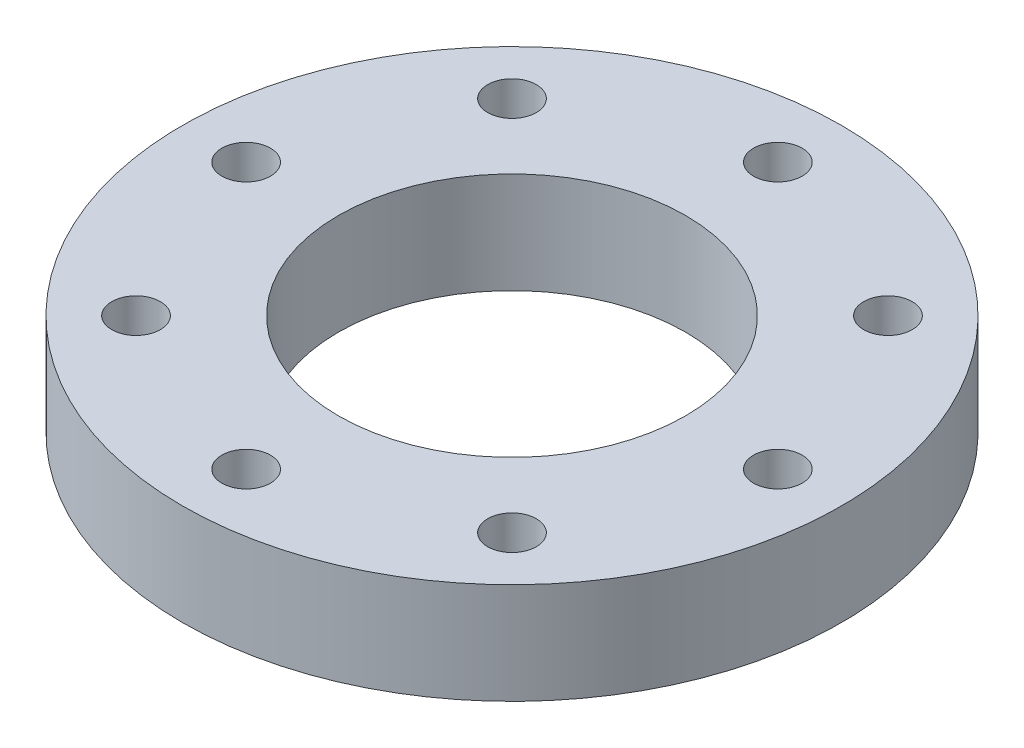
ISO-10303-21;
HEADER;
FILE_DESCRIPTION(('STEP AP214'),'2;1');
FILE_NAME('part.step','',(''),(''),'','','');
FILE_SCHEMA(('AUTOMOTIVE_DESIGN { 1 0 10303 214 1 1 1 1 }'));
ENDSEC;
DATA;
#1=APPLICATION_CONTEXT('core data for automotive mechanical design processes');
#2=APPLICATION_PROTOCOL_DEFINITION('international standard','automotive_design',2000,#1);
#3=PRODUCT_CONTEXT('',#1,'mechanical');
#4=PRODUCT('Part','Part','',(#3));
#5=PRODUCT_RELATED_PRODUCT_CATEGORY('part','',(#4));
#6=PRODUCT_DEFINITION_FORMATION('','',#4);
#7=PRODUCT_DEFINITION_CONTEXT('part definition',#1,'design');
#8=PRODUCT_DEFINITION('design','',#6,#7);
#9=PRODUCT_DEFINITION_SHAPE('','',#8);
#10=(LENGTH_UNIT() NAMED_UNIT(*) SI_UNIT(.MILLI.,.METRE.));
#11=(NAMED_UNIT(*) PLANE_ANGLE_UNIT() SI_UNIT($,.RADIAN.));
#12=(NAMED_UNIT(*) SI_UNIT($,.STERADIAN.) SOLID_ANGLE_UNIT());
#13=UNCERTAINTY_MEASURE_WITH_UNIT(LENGTH_MEASURE(1.E-05),#10,'distance_accuracy_value','');
#14=(GEOMETRIC_REPRESENTATION_CONTEXT(3) GLOBAL_UNCERTAINTY_ASSIGNED_CONTEXT((#13)) GLOBAL_UNIT_ASSIGNED_CONTEXT((#10,
#11,#12)) REPRESENTATION_CONTEXT('',''));
#15=CARTESIAN_POINT('',(0.,0.,0.));
#16=DIRECTION('',(0.,0.,1.));
#17=DIRECTION('',(1.,0.,0.));
#18=AXIS2_PLACEMENT_3D('',#15,#16,#17);
#19=CARTESIAN_POINT('',(0.,17.526,0.));
#20=DIRECTION('',(0.,1.,0.));
#21=DIRECTION('',(0.,0.,1.));
#22=AXIS2_PLACEMENT_3D('',#19,#20,#21);
#23=PLANE('',#22);
#24=CARTESIAN_POINT('',(46.101,17.526,-4.82882343606022E-13));
#25=DIRECTION('',(0.,1.,0.));
#26=DIRECTION('',(-1.,0.,0.));
#27=AXIS2_PLACEMENT_3D('',#24,#25,#26);
#28=CIRCLE('',#27,4.2164);
#29=CARTESIAN_POINT('',(41.8846,17.526,-4.38717897854727E-13));
#30=VERTEX_POINT('',#29);
#31=EDGE_CURVE('E90',#30,#30,#28,.T.);
#32=ORIENTED_EDGE('',*,*,#31,.F.);
#33=EDGE_LOOP('',(#32));
#34=FACE_BOUND('',#33,.T.);
#35=CARTESIAN_POINT('',(3.21921562404015E-13,17.526,46.101));
#36=DIRECTION('',(0.,1.,0.));
#37=DIRECTION('',(0.,0.,-1.));
#38=AXIS2_PLACEMENT_3D('',#35,#36,#37);
#39=CIRCLE('',#38,4.2164);
#40=CARTESIAN_POINT('',(2.92478598569818E-13,17.526,41.8846));
#41=VERTEX_POINT('',#40);
#42=EDGE_CURVE('E78',#41,#41,#39,.T.);
#43=ORIENTED_EDGE('',*,*,#42,.F.);
#44=EDGE_LOOP('',(#43));
#45=FACE_BOUND('',#44,.T.);
#46=CARTESIAN_POINT('',(-46.101,17.526,1.60960781202007E-13));
#47=DIRECTION('',(0.,1.,0.));
#48=DIRECTION('',(1.,0.,0.));
#49=AXIS2_PLACEMENT_3D('',#46,#47,#48);
#50=CIRCLE('',#49,4.2164);
#51=CARTESIAN_POINT('',(-41.8846,17.526,1.46239299284909E-13));
#52=VERTEX_POINT('',#51);
#53=EDGE_CURVE('E66',#52,#52,#50,.T.);
#54=ORIENTED_EDGE('',*,*,#53,.F.);
#55=EDGE_LOOP('',(#54));
#56=FACE_BOUND('',#55,.T.);
#57=CARTESIAN_POINT('',(0.,17.526,-46.101));
#58=DIRECTION('',(0.,1.,0.));
#59=DIRECTION('',(0.,0.,1.));
#60=AXIS2_PLACEMENT_3D('',#57,#58,#59);
#61=CIRCLE('',#60,4.2164);
#62=CARTESIAN_POINT('',(0.,17.526,-41.8846));
#63=VERTEX_POINT('',#62);
#64=EDGE_CURVE('E54',#63,#63,#61,.T.);
#65=ORIENTED_EDGE('',*,*,#64,.F.);
#66=EDGE_LOOP('',(#65));
#67=FACE_BOUND('',#66,.T.);
#68=CARTESIAN_POINT('',(0.,17.526,0.));
#69=DIRECTION('',(0.,1.,0.));
#70=DIRECTION('',(0.,0.,1.));
#71=AXIS2_PLACEMENT_3D('',#68,#69,#70);
#72=CIRCLE('',#71,57.15);
#73=CARTESIAN_POINT('',(0.,17.526,57.15));
#74=VERTEX_POINT('',#73);
#75=EDGE_CURVE('E11',#74,#74,#72,.T.);
#76=ORIENTED_EDGE('',*,*,#75,.T.);
#77=EDGE_LOOP('',(#76));
#78=FACE_BOUND('',#77,.T.);
#79=CARTESIAN_POINT('',(0.,17.526,0.));
#80=DIRECTION('',(0.,1.,0.));
#81=DIRECTION('',(1.,0.,0.));
#82=AXIS2_PLACEMENT_3D('',#79,#80,#81);
#83=CIRCLE('',#82,30.099);
#84=CARTESIAN_POINT('',(30.099,17.526,0.));
#85=VERTEX_POINT('',#84);
#86=EDGE_CURVE('E49',#85,#85,#83,.T.);
#87=ORIENTED_EDGE('',*,*,#86,.F.);
#88=EDGE_LOOP('',(#87));
#89=FACE_BOUND('',#88,.T.);
#90=CARTESIAN_POINT('',(-32.5983297194811,17.526,-32.598329719481));
#91=DIRECTION('',(0.,1.,0.));
#92=DIRECTION('',(0.707106781186549,0.,0.707106781186546));
#93=AXIS2_PLACEMENT_3D('',#90,#91,#92);
#94=CIRCLE('',#93,4.2164);
#95=CARTESIAN_POINT('',(-29.6168846872861,17.526,-29.616884687286));
#96=VERTEX_POINT('',#95);
#97=EDGE_CURVE('E60',#96,#96,#94,.T.);
#98=ORIENTED_EDGE('',*,*,#97,.F.);
#99=EDGE_LOOP('',(#98));
#100=FACE_BOUND('',#99,.T.);
#101=CARTESIAN_POINT('',(-32.5983297194809,17.526,32.5983297194812));
#102=DIRECTION('',(0.,1.,0.));
#103=DIRECTION('',(0.707106781186544,0.,-0.707106781186551));
#104=AXIS2_PLACEMENT_3D('',#101,#102,#103);
#105=CIRCLE('',#104,4.2164);
#106=CARTESIAN_POINT('',(-29.6168846872859,17.526,29.6168846872862));
#107=VERTEX_POINT('',#106);
#108=EDGE_CURVE('E72',#107,#107,#105,.T.);
#109=ORIENTED_EDGE('',*,*,#108,.F.);
#110=EDGE_LOOP('',(#109));
#111=FACE_BOUND('',#110,.T.);
#112=CARTESIAN_POINT('',(32.5983297194813,17.526,32.5983297194807));
#113=DIRECTION('',(0.,1.,0.));
#114=DIRECTION('',(-0.707106781186554,0.,-0.707106781186541));
#115=AXIS2_PLACEMENT_3D('',#112,#113,#114);
#116=CIRCLE('',#115,4.2164);
#117=CARTESIAN_POINT('',(29.6168846872863,17.526,29.6168846872858));
#118=VERTEX_POINT('',#117);
#119=EDGE_CURVE('E84',#118,#118,#116,.T.);
#120=ORIENTED_EDGE('',*,*,#119,.F.);
#121=EDGE_LOOP('',(#120));
#122=FACE_BOUND('',#121,.T.);
#123=CARTESIAN_POINT('',(32.5983297194806,17.526,-32.5983297194814));
#124=DIRECTION('',(0.,1.,0.));
#125=DIRECTION('',(-0.707106781186539,0.,0.707106781186556));
#126=AXIS2_PLACEMENT_3D('',#123,#124,#125);
#127=CIRCLE('',#126,4.2164);
#128=CARTESIAN_POINT('',(29.6168846872857,17.526,-29.6168846872864));
#129=VERTEX_POINT('',#128);
#130=EDGE_CURVE('E96',#129,#129,#127,.T.);
#131=ORIENTED_EDGE('',*,*,#130,.F.);
#132=EDGE_LOOP('',(#131));
#133=FACE_BOUND('',#132,.T.);
#134=ADVANCED_FACE('F38',(#34,#45,#56,#67,#78,#89,#100,#111,#122,#133),#23,.T.);
#135=CARTESIAN_POINT('',(0.,0.,0.));
#136=DIRECTION('',(0.,1.,0.));
#137=DIRECTION('',(0.,0.,1.));
#138=AXIS2_PLACEMENT_3D('',#135,#136,#137);
#139=PLANE('',#138);
#140=CARTESIAN_POINT('',(46.101,0.,-4.82882343606022E-13));
#141=DIRECTION('',(0.,1.,0.));
#142=DIRECTION('',(-1.,0.,0.));
#143=AXIS2_PLACEMENT_3D('',#140,#141,#142);
#144=CIRCLE('',#143,4.2164);
#145=CARTESIAN_POINT('',(41.8846,0.,-4.38717897854727E-13));
#146=VERTEX_POINT('',#145);
#147=EDGE_CURVE('E93',#146,#146,#144,.T.);
#148=ORIENTED_EDGE('',*,*,#147,.T.);
#149=EDGE_LOOP('',(#148));
#150=FACE_BOUND('',#149,.T.);
#151=CARTESIAN_POINT('',(3.21921562404015E-13,0.,46.101));
#152=DIRECTION('',(0.,1.,0.));
#153=DIRECTION('',(0.,0.,-1.));
#154=AXIS2_PLACEMENT_3D('',#151,#152,#153);
#155=CIRCLE('',#154,4.2164);
#156=CARTESIAN_POINT('',(2.92478598569818E-13,0.,41.8846));
#157=VERTEX_POINT('',#156);
#158=EDGE_CURVE('E81',#157,#157,#155,.T.);
#159=ORIENTED_EDGE('',*,*,#158,.T.);
#160=EDGE_LOOP('',(#159));
#161=FACE_BOUND('',#160,.T.);
#162=CARTESIAN_POINT('',(-46.101,0.,1.60960781202007E-13));
#163=DIRECTION('',(0.,1.,0.));
#164=DIRECTION('',(1.,0.,0.));
#165=AXIS2_PLACEMENT_3D('',#162,#163,#164);
#166=CIRCLE('',#165,4.2164);
#167=CARTESIAN_POINT('',(-41.8846,0.,1.46239299284909E-13));
#168=VERTEX_POINT('',#167);
#169=EDGE_CURVE('E69',#168,#168,#166,.T.);
#170=ORIENTED_EDGE('',*,*,#169,.T.);
#171=EDGE_LOOP('',(#170));
#172=FACE_BOUND('',#171,.T.);
#173=CARTESIAN_POINT('',(0.,0.,-46.101));
#174=DIRECTION('',(0.,1.,0.));
#175=DIRECTION('',(0.,0.,1.));
#176=AXIS2_PLACEMENT_3D('',#173,#174,#175);
#177=CIRCLE('',#176,4.2164);
#178=CARTESIAN_POINT('',(0.,0.,-41.8846));
#179=VERTEX_POINT('',#178);
#180=EDGE_CURVE('E57',#179,#179,#177,.T.);
#181=ORIENTED_EDGE('',*,*,#180,.T.);
#182=EDGE_LOOP('',(#181));
#183=FACE_BOUND('',#182,.T.);
#184=CARTESIAN_POINT('',(0.,0.,0.));
#185=DIRECTION('',(0.,1.,0.));
#186=DIRECTION('',(0.,0.,1.));
#187=AXIS2_PLACEMENT_3D('',#184,#185,#186);
#188=CIRCLE('',#187,57.15);
#189=CARTESIAN_POINT('',(0.,0.,57.15));
#190=VERTEX_POINT('',#189);
#191=EDGE_CURVE('E42',#190,#190,#188,.T.);
#192=ORIENTED_EDGE('',*,*,#191,.F.);
#193=EDGE_LOOP('',(#192));
#194=FACE_BOUND('',#193,.T.);
#195=CARTESIAN_POINT('',(0.,0.,0.));
#196=DIRECTION('',(0.,1.,0.));
#197=DIRECTION('',(1.,0.,0.));
#198=AXIS2_PLACEMENT_3D('',#195,#196,#197);
#199=CIRCLE('',#198,30.099);
#200=CARTESIAN_POINT('',(30.099,0.,0.));
#201=VERTEX_POINT('',#200);
#202=EDGE_CURVE('E51',#201,#201,#199,.T.);
#203=ORIENTED_EDGE('',*,*,#202,.T.);
#204=EDGE_LOOP('',(#203));
#205=FACE_BOUND('',#204,.T.);
#206=CARTESIAN_POINT('',(-32.5983297194811,0.,-32.598329719481));
#207=DIRECTION('',(0.,1.,0.));
#208=DIRECTION('',(0.707106781186549,0.,0.707106781186546));
#209=AXIS2_PLACEMENT_3D('',#206,#207,#208);
#210=CIRCLE('',#209,4.2164);
#211=CARTESIAN_POINT('',(-29.6168846872861,0.,-29.616884687286));
#212=VERTEX_POINT('',#211);
#213=EDGE_CURVE('E63',#212,#212,#210,.T.);
#214=ORIENTED_EDGE('',*,*,#213,.T.);
#215=EDGE_LOOP('',(#214));
#216=FACE_BOUND('',#215,.T.);
#217=CARTESIAN_POINT('',(-32.5983297194809,0.,32.5983297194812));
#218=DIRECTION('',(0.,1.,0.));
#219=DIRECTION('',(0.707106781186544,0.,-0.707106781186551));
#220=AXIS2_PLACEMENT_3D('',#217,#218,#219);
#221=CIRCLE('',#220,4.2164);
#222=CARTESIAN_POINT('',(-29.6168846872859,0.,29.6168846872862));
#223=VERTEX_POINT('',#222);
#224=EDGE_CURVE('E75',#223,#223,#221,.T.);
#225=ORIENTED_EDGE('',*,*,#224,.T.);
#226=EDGE_LOOP('',(#225));
#227=FACE_BOUND('',#226,.T.);
#228=CARTESIAN_POINT('',(32.5983297194813,0.,32.5983297194807));
#229=DIRECTION('',(0.,1.,0.));
#230=DIRECTION('',(-0.707106781186554,0.,-0.707106781186541));
#231=AXIS2_PLACEMENT_3D('',#228,#229,#230);
#232=CIRCLE('',#231,4.2164);
#233=CARTESIAN_POINT('',(29.6168846872863,0.,29.6168846872858));
#234=VERTEX_POINT('',#233);
#235=EDGE_CURVE('E87',#234,#234,#232,.T.);
#236=ORIENTED_EDGE('',*,*,#235,.T.);
#237=EDGE_LOOP('',(#236));
#238=FACE_BOUND('',#237,.T.);
#239=CARTESIAN_POINT('',(32.5983297194806,0.,-32.5983297194814));
#240=DIRECTION('',(0.,1.,0.));
#241=DIRECTION('',(-0.707106781186539,0.,0.707106781186556));
#242=AXIS2_PLACEMENT_3D('',#239,#240,#241);
#243=CIRCLE('',#242,4.2164);
#244=CARTESIAN_POINT('',(29.6168846872857,0.,-29.6168846872864));
#245=VERTEX_POINT('',#244);
#246=EDGE_CURVE('E99',#245,#245,#243,.T.);
#247=ORIENTED_EDGE('',*,*,#246,.T.);
#248=EDGE_LOOP('',(#247));
#249=FACE_BOUND('',#248,.T.);
#250=ADVANCED_FACE('F109',(#150,#161,#172,#183,#194,#205,#216,#227,#238,#249),#139,.F.);
#251=CARTESIAN_POINT('',(0.,17.526,0.));
#252=DIRECTION('',(0.,-1.,0.));
#253=DIRECTION('',(0.,0.,-1.));
#254=AXIS2_PLACEMENT_3D('',#251,#252,#253);
#255=CYLINDRICAL_SURFACE('',#254,57.15);
#256=ORIENTED_EDGE('',*,*,#75,.F.);
#257=EDGE_LOOP('',(#256));
#258=FACE_BOUND('',#257,.T.);
#259=ORIENTED_EDGE('',*,*,#191,.T.);
#260=EDGE_LOOP('',(#259));
#261=FACE_BOUND('',#260,.T.);
#262=ADVANCED_FACE('F40',(#258,#261),#255,.T.);
#263=CARTESIAN_POINT('',(0.,17.526,0.));
#264=DIRECTION('',(0.,-1.,0.));
#265=DIRECTION('',(0.,0.,-1.));
#266=AXIS2_PLACEMENT_3D('',#263,#264,#265);
#267=CYLINDRICAL_SURFACE('',#266,30.099);
#268=ORIENTED_EDGE('',*,*,#86,.T.);
#269=EDGE_LOOP('',(#268));
#270=FACE_BOUND('',#269,.T.);
#271=ORIENTED_EDGE('',*,*,#202,.F.);
#272=EDGE_LOOP('',(#271));
#273=FACE_BOUND('',#272,.T.);
#274=ADVANCED_FACE('F119',(#270,#273),#267,.F.);
#275=CARTESIAN_POINT('',(0.,17.526,-46.101));
#276=DIRECTION('',(0.,-1.,0.));
#277=DIRECTION('',(0.,0.,-1.));
#278=AXIS2_PLACEMENT_3D('',#275,#276,#277);
#279=CYLINDRICAL_SURFACE('',#278,4.2164);
#280=ORIENTED_EDGE('',*,*,#64,.T.);
#281=EDGE_LOOP('',(#280));
#282=FACE_BOUND('',#281,.T.);
#283=ORIENTED_EDGE('',*,*,#180,.F.);
#284=EDGE_LOOP('',(#283));
#285=FACE_BOUND('',#284,.T.);
#286=ADVANCED_FACE('F122',(#282,#285),#279,.F.);
#287=CARTESIAN_POINT('',(-32.5983297194811,17.526,-32.598329719481));
#288=DIRECTION('',(0.,-1.,0.));
#289=DIRECTION('',(0.,0.,-1.));
#290=AXIS2_PLACEMENT_3D('',#287,#288,#289);
#291=CYLINDRICAL_SURFACE('',#290,4.2164);
#292=ORIENTED_EDGE('',*,*,#97,.T.);
#293=EDGE_LOOP('',(#292));
#294=FACE_BOUND('',#293,.T.);
#295=ORIENTED_EDGE('',*,*,#213,.F.);
#296=EDGE_LOOP('',(#295));
#297=FACE_BOUND('',#296,.T.);
#298=ADVANCED_FACE('F126',(#294,#297),#291,.F.);
#299=CARTESIAN_POINT('',(-46.101,17.526,1.60960781202007E-13));
#300=DIRECTION('',(0.,-1.,0.));
#301=DIRECTION('',(0.,0.,-1.));
#302=AXIS2_PLACEMENT_3D('',#299,#300,#301);
#303=CYLINDRICAL_SURFACE('',#302,4.2164);
#304=ORIENTED_EDGE('',*,*,#53,.T.);
#305=EDGE_LOOP('',(#304));
#306=FACE_BOUND('',#305,.T.);
#307=ORIENTED_EDGE('',*,*,#169,.F.);
#308=EDGE_LOOP('',(#307));
#309=FACE_BOUND('',#308,.T.);
#310=ADVANCED_FACE('F130',(#306,#309),#303,.F.);
#311=CARTESIAN_POINT('',(-32.5983297194809,17.526,32.5983297194812));
#312=DIRECTION('',(0.,-1.,0.));
#313=DIRECTION('',(0.,0.,-1.));
#314=AXIS2_PLACEMENT_3D('',#311,#312,#313);
#315=CYLINDRICAL_SURFACE('',#314,4.2164);
#316=ORIENTED_EDGE('',*,*,#108,.T.);
#317=EDGE_LOOP('',(#316));
#318=FACE_BOUND('',#317,.T.);
#319=ORIENTED_EDGE('',*,*,#224,.F.);
#320=EDGE_LOOP('',(#319));
#321=FACE_BOUND('',#320,.T.);
#322=ADVANCED_FACE('F134',(#318,#321),#315,.F.);
#323=CARTESIAN_POINT('',(3.21921562404015E-13,17.526,46.101));
#324=DIRECTION('',(0.,-1.,0.));
#325=DIRECTION('',(0.,0.,-1.));
#326=AXIS2_PLACEMENT_3D('',#323,#324,#325);
#327=CYLINDRICAL_SURFACE('',#326,4.2164);
#328=ORIENTED_EDGE('',*,*,#42,.T.);
#329=EDGE_LOOP('',(#328));
#330=FACE_BOUND('',#329,.T.);
#331=ORIENTED_EDGE('',*,*,#158,.F.);
#332=EDGE_LOOP('',(#331));
#333=FACE_BOUND('',#332,.T.);
#334=ADVANCED_FACE('F138',(#330,#333),#327,.F.);
#335=CARTESIAN_POINT('',(32.5983297194813,17.526,32.5983297194807));
#336=DIRECTION('',(0.,-1.,0.));
#337=DIRECTION('',(0.,0.,-1.));
#338=AXIS2_PLACEMENT_3D('',#335,#336,#337);
#339=CYLINDRICAL_SURFACE('',#338,4.2164);
#340=ORIENTED_EDGE('',*,*,#119,.T.);
#341=EDGE_LOOP('',(#340));
#342=FACE_BOUND('',#341,.T.);
#343=ORIENTED_EDGE('',*,*,#235,.F.);
#344=EDGE_LOOP('',(#343));
#345=FACE_BOUND('',#344,.T.);
#346=ADVANCED_FACE('F142',(#342,#345),#339,.F.);
#347=CARTESIAN_POINT('',(46.101,17.526,-4.82882343606022E-13));
#348=DIRECTION('',(0.,-1.,0.));
#349=DIRECTION('',(0.,0.,-1.));
#350=AXIS2_PLACEMENT_3D('',#347,#348,#349);
#351=CYLINDRICAL_SURFACE('',#350,4.2164);
#352=ORIENTED_EDGE('',*,*,#31,.T.);
#353=EDGE_LOOP('',(#352));
#354=FACE_BOUND('',#353,.T.);
#355=ORIENTED_EDGE('',*,*,#147,.F.);
#356=EDGE_LOOP('',(#355));
#357=FACE_BOUND('',#356,.T.);
#358=ADVANCED_FACE('F146',(#354,#357),#351,.F.);
#359=CARTESIAN_POINT('',(32.5983297194806,17.526,-32.5983297194814));
#360=DIRECTION('',(0.,-1.,0.));
#361=DIRECTION('',(0.,0.,-1.));
#362=AXIS2_PLACEMENT_3D('',#359,#360,#361);
#363=CYLINDRICAL_SURFACE('',#362,4.2164);
#364=ORIENTED_EDGE('',*,*,#130,.T.);
#365=EDGE_LOOP('',(#364));
#366=FACE_BOUND('',#365,.T.);
#367=ORIENTED_EDGE('',*,*,#246,.F.);
#368=EDGE_LOOP('',(#367));
#369=FACE_BOUND('',#368,.T.);
#370=ADVANCED_FACE('F105',(#366,#369),#363,.F.);
#371=CLOSED_SHELL('',(#134,#250,#262,#274,#286,#298,#310,#322,#334,#346,#358,#370));
#372=MANIFOLD_SOLID_BREP('B2',#371);
#373=ADVANCED_BREP_SHAPE_REPRESENTATION('',(#18,#372),#14);
#374=SHAPE_DEFINITION_REPRESENTATION(#9,#373);
ENDSEC;
END-ISO-10303-21;
